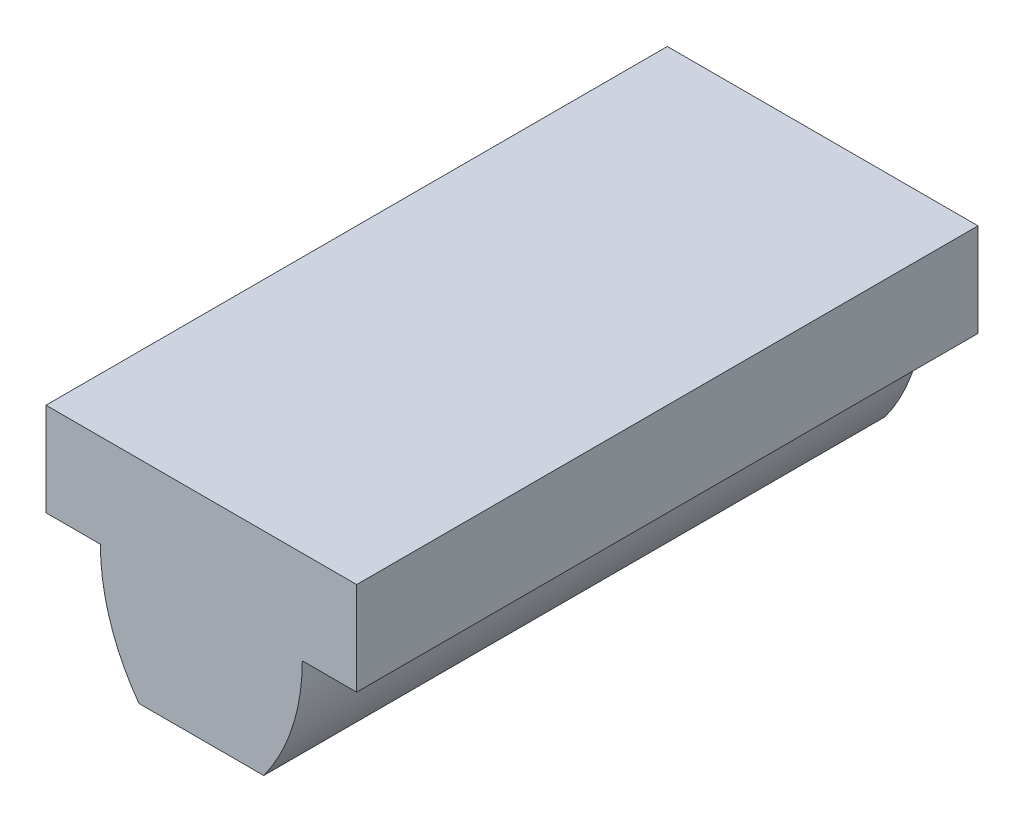
ISO-10303-21;
HEADER;
FILE_DESCRIPTION(('STEP AP214'),'2;1');
FILE_NAME('part.step','',(''),(''),'','','');
FILE_SCHEMA(('AUTOMOTIVE_DESIGN { 1 0 10303 214 1 1 1 1 }'));
ENDSEC;
DATA;
#1=APPLICATION_CONTEXT('core data for automotive mechanical design processes');
#2=APPLICATION_PROTOCOL_DEFINITION('international standard','automotive_design',2000,#1);
#3=PRODUCT_CONTEXT('',#1,'mechanical');
#4=PRODUCT('Part','Part','',(#3));
#5=PRODUCT_RELATED_PRODUCT_CATEGORY('part','',(#4));
#6=PRODUCT_DEFINITION_FORMATION('','',#4);
#7=PRODUCT_DEFINITION_CONTEXT('part definition',#1,'design');
#8=PRODUCT_DEFINITION('design','',#6,#7);
#9=PRODUCT_DEFINITION_SHAPE('','',#8);
#10=(LENGTH_UNIT() NAMED_UNIT(*) SI_UNIT(.MILLI.,.METRE.));
#11=(NAMED_UNIT(*) PLANE_ANGLE_UNIT() SI_UNIT($,.RADIAN.));
#12=(NAMED_UNIT(*) SI_UNIT($,.STERADIAN.) SOLID_ANGLE_UNIT());
#13=UNCERTAINTY_MEASURE_WITH_UNIT(LENGTH_MEASURE(1.E-05),#10,'distance_accuracy_value','');
#14=(GEOMETRIC_REPRESENTATION_CONTEXT(3) GLOBAL_UNCERTAINTY_ASSIGNED_CONTEXT((#13)) GLOBAL_UNIT_ASSIGNED_CONTEXT((#10,
#11,#12)) REPRESENTATION_CONTEXT('',''));
#15=CARTESIAN_POINT('',(0.,0.,0.));
#16=DIRECTION('',(0.,0.,1.));
#17=DIRECTION('',(1.,0.,0.));
#18=AXIS2_PLACEMENT_3D('',#15,#16,#17);
#19=CARTESIAN_POINT('',(0.,13.7523955,5.));
#20=DIRECTION('',(0.,1.,0.));
#21=DIRECTION('',(1.,0.,0.));
#22=AXIS2_PLACEMENT_3D('',#19,#20,#21);
#23=PLANE('',#22);
#24=DIRECTION('',(1.,0.,0.));
#25=VECTOR('',#24,1.);
#26=CARTESIAN_POINT('',(0.,13.7523955,5.));
#27=LINE('',#26,#25);
#28=CARTESIAN_POINT('',(20.,13.7523955,5.));
#29=VERTEX_POINT('',#28);
#30=CARTESIAN_POINT('',(25.,13.7523955,5.));
#31=VERTEX_POINT('',#30);
#32=EDGE_CURVE('E126',#29,#31,#27,.T.);
#33=ORIENTED_EDGE('',*,*,#32,.T.);
#34=DIRECTION('',(0.,0.,-1.));
#35=VECTOR('',#34,1.);
#36=CARTESIAN_POINT('',(25.,13.7523955,5.));
#37=LINE('',#36,#35);
#38=CARTESIAN_POINT('',(25.,13.7523955,-5.));
#39=VERTEX_POINT('',#38);
#40=EDGE_CURVE('E114',#31,#39,#37,.T.);
#41=ORIENTED_EDGE('',*,*,#40,.T.);
#42=DIRECTION('',(-1.,0.,0.));
#43=VECTOR('',#42,1.);
#44=CARTESIAN_POINT('',(0.,13.7523955,-5.));
#45=LINE('',#44,#43);
#46=CARTESIAN_POINT('',(20.,13.7523955,-5.));
#47=VERTEX_POINT('',#46);
#48=EDGE_CURVE('E124',#39,#47,#45,.T.);
#49=ORIENTED_EDGE('',*,*,#48,.T.);
#50=DIRECTION('',(0.,0.,1.));
#51=VECTOR('',#50,1.);
#52=CARTESIAN_POINT('',(20.,13.7523955,5.));
#53=LINE('',#52,#51);
#54=EDGE_CURVE('E128',#47,#29,#53,.T.);
#55=ORIENTED_EDGE('',*,*,#54,.T.);
#56=EDGE_LOOP('',(#33,#41,#49,#55));
#57=FACE_BOUND('',#56,.T.);
#58=ADVANCED_FACE('F41',(#57),#23,.T.);
#59=CARTESIAN_POINT('',(-14.3825635665263,-13.7523955,5.));
#60=DIRECTION('',(0.,0.,1.));
#61=DIRECTION('',(1.,0.,0.));
#62=AXIS2_PLACEMENT_3D('',#59,#60,#61);
#63=PLANE('',#62);
#64=DIRECTION('',(1.,0.,0.));
#65=VECTOR('',#64,1.);
#66=CARTESIAN_POINT('',(-14.3825635665263,12.2523954999998,5.));
#67=LINE('',#66,#65);
#68=CARTESIAN_POINT('',(24.125,12.2523954999999,5.));
#69=VERTEX_POINT('',#68);
#70=CARTESIAN_POINT('',(25.,12.2523954999998,5.));
#71=VERTEX_POINT('',#70);
#72=EDGE_CURVE('E144',#69,#71,#67,.T.);
#73=ORIENTED_EDGE('',*,*,#72,.T.);
#74=DIRECTION('',(0.,-1.,0.));
#75=VECTOR('',#74,1.);
#76=CARTESIAN_POINT('',(25.,12.2523954999999,5.));
#77=LINE('',#76,#75);
#78=EDGE_CURVE('E56',#31,#71,#77,.T.);
#79=ORIENTED_EDGE('',*,*,#78,.F.);
#80=ORIENTED_EDGE('',*,*,#32,.F.);
#81=DIRECTION('',(0.,1.,0.));
#82=VECTOR('',#81,1.);
#83=CARTESIAN_POINT('',(20.,12.2523954999999,5.));
#84=LINE('',#83,#82);
#85=CARTESIAN_POINT('',(20.,12.2523955,5.));
#86=VERTEX_POINT('',#85);
#87=EDGE_CURVE('E118',#86,#29,#84,.T.);
#88=ORIENTED_EDGE('',*,*,#87,.F.);
#89=DIRECTION('',(1.,0.,0.));
#90=VECTOR('',#89,1.);
#91=CARTESIAN_POINT('',(-14.3825635665263,12.2523954999998,5.));
#92=LINE('',#91,#90);
#93=CARTESIAN_POINT('',(20.875,12.252395499999,5.));
#94=VERTEX_POINT('',#93);
#95=EDGE_CURVE('E133',#86,#94,#92,.T.);
#96=ORIENTED_EDGE('',*,*,#95,.T.);
#97=CARTESIAN_POINT('',(24.1249999999942,12.2523954999983,5.));
#98=DIRECTION('',(0.,0.,1.));
#99=DIRECTION('',(-1.,0.,0.));
#100=AXIS2_PLACEMENT_3D('',#97,#98,#99);
#101=CIRCLE('',#100,3.24999999999418);
#102=CARTESIAN_POINT('',(21.495475328125,10.3423955,5.));
#103=VERTEX_POINT('',#102);
#104=EDGE_CURVE('E141',#94,#103,#101,.T.);
#105=ORIENTED_EDGE('',*,*,#104,.T.);
#106=DIRECTION('',(1.,0.,0.));
#107=VECTOR('',#106,1.);
#108=CARTESIAN_POINT('',(-14.3825635665263,10.3423955,5.));
#109=LINE('',#108,#107);
#110=CARTESIAN_POINT('',(23.504524671875,10.3423955,5.));
#111=VERTEX_POINT('',#110);
#112=EDGE_CURVE('E186',#103,#111,#109,.T.);
#113=ORIENTED_EDGE('',*,*,#112,.T.);
#114=CARTESIAN_POINT('',(20.8750000000059,12.2523954999983,5.));
#115=DIRECTION('',(0.,0.,1.));
#116=DIRECTION('',(-1.,0.,0.));
#117=AXIS2_PLACEMENT_3D('',#114,#115,#116);
#118=CIRCLE('',#117,3.24999999999416);
#119=EDGE_CURVE('E148',#111,#69,#118,.T.);
#120=ORIENTED_EDGE('',*,*,#119,.T.);
#121=EDGE_LOOP('',(#73,#79,#80,#88,#96,#105,#113,#120));
#122=FACE_BOUND('',#121,.T.);
#123=ADVANCED_FACE('F43',(#122),#63,.T.);
#124=CARTESIAN_POINT('',(-14.3825635665263,-13.7523955,-5.));
#125=DIRECTION('',(0.,0.,-1.));
#126=DIRECTION('',(0.,-1.,0.));
#127=AXIS2_PLACEMENT_3D('',#124,#125,#126);
#128=PLANE('',#127);
#129=ORIENTED_EDGE('',*,*,#48,.F.);
#130=DIRECTION('',(0.,-1.,0.));
#131=VECTOR('',#130,1.);
#132=CARTESIAN_POINT('',(25.,9.86876750418667,-5.));
#133=LINE('',#132,#131);
#134=CARTESIAN_POINT('',(25.,12.2523955,-5.));
#135=VERTEX_POINT('',#134);
#136=EDGE_CURVE('E111',#39,#135,#133,.T.);
#137=ORIENTED_EDGE('',*,*,#136,.T.);
#138=DIRECTION('',(-1.,0.,0.));
#139=VECTOR('',#138,1.);
#140=CARTESIAN_POINT('',(-14.3825635665263,12.2523955,-5.));
#141=LINE('',#140,#139);
#142=CARTESIAN_POINT('',(24.125,12.2523955,-5.));
#143=VERTEX_POINT('',#142);
#144=EDGE_CURVE('E149',#135,#143,#141,.T.);
#145=ORIENTED_EDGE('',*,*,#144,.T.);
#146=CARTESIAN_POINT('',(20.8750000000059,12.2523954999983,-5.));
#147=DIRECTION('',(0.,0.,-1.));
#148=DIRECTION('',(-1.,0.,0.));
#149=AXIS2_PLACEMENT_3D('',#146,#147,#148);
#150=CIRCLE('',#149,3.24999999999416);
#151=CARTESIAN_POINT('',(23.504524671875,10.3423955,-5.));
#152=VERTEX_POINT('',#151);
#153=EDGE_CURVE('E190',#143,#152,#150,.T.);
#154=ORIENTED_EDGE('',*,*,#153,.T.);
#155=DIRECTION('',(-1.,0.,0.));
#156=VECTOR('',#155,1.);
#157=CARTESIAN_POINT('',(-14.3825635665263,10.3423955,-5.));
#158=LINE('',#157,#156);
#159=CARTESIAN_POINT('',(21.495475328125,10.3423955,-5.));
#160=VERTEX_POINT('',#159);
#161=EDGE_CURVE('E158',#152,#160,#158,.T.);
#162=ORIENTED_EDGE('',*,*,#161,.T.);
#163=CARTESIAN_POINT('',(24.1249999999942,12.2523954999983,-5.));
#164=DIRECTION('',(0.,0.,-1.));
#165=DIRECTION('',(-1.,0.,0.));
#166=AXIS2_PLACEMENT_3D('',#163,#164,#165);
#167=CIRCLE('',#166,3.24999999999418);
#168=CARTESIAN_POINT('',(20.875,12.2523954999991,-5.));
#169=VERTEX_POINT('',#168);
#170=EDGE_CURVE('E153',#160,#169,#167,.T.);
#171=ORIENTED_EDGE('',*,*,#170,.T.);
#172=DIRECTION('',(-1.,0.,0.));
#173=VECTOR('',#172,1.);
#174=CARTESIAN_POINT('',(-14.3825635665263,12.2523955,-5.));
#175=LINE('',#174,#173);
#176=CARTESIAN_POINT('',(20.,12.2523955,-5.));
#177=VERTEX_POINT('',#176);
#178=EDGE_CURVE('E150',#169,#177,#175,.T.);
#179=ORIENTED_EDGE('',*,*,#178,.T.);
#180=DIRECTION('',(0.,1.,0.));
#181=VECTOR('',#180,1.);
#182=CARTESIAN_POINT('',(20.,12.2523954999999,-5.));
#183=LINE('',#182,#181);
#184=EDGE_CURVE('E63',#177,#47,#183,.T.);
#185=ORIENTED_EDGE('',*,*,#184,.T.);
#186=EDGE_LOOP('',(#129,#137,#145,#154,#162,#171,#179,#185));
#187=FACE_BOUND('',#186,.T.);
#188=ADVANCED_FACE('F130',(#187),#128,.T.);
#189=CARTESIAN_POINT('',(24.125,12.2523955,-5.));
#190=DIRECTION('',(0.,-1.,0.));
#191=DIRECTION('',(0.,0.,-1.));
#192=AXIS2_PLACEMENT_3D('',#189,#190,#191);
#193=PLANE('',#192);
#194=ORIENTED_EDGE('',*,*,#144,.F.);
#195=DIRECTION('',(0.,0.,1.));
#196=VECTOR('',#195,1.);
#197=CARTESIAN_POINT('',(25.,12.2523955,-5.));
#198=LINE('',#197,#196);
#199=EDGE_CURVE('E12',#135,#71,#198,.T.);
#200=ORIENTED_EDGE('',*,*,#199,.T.);
#201=ORIENTED_EDGE('',*,*,#72,.F.);
#202=DIRECTION('',(0.,0.,-1.));
#203=VECTOR('',#202,1.);
#204=CARTESIAN_POINT('',(24.125,12.2523955,-5.));
#205=LINE('',#204,#203);
#206=EDGE_CURVE('E154',#69,#143,#205,.T.);
#207=ORIENTED_EDGE('',*,*,#206,.T.);
#208=EDGE_LOOP('',(#194,#200,#201,#207));
#209=FACE_BOUND('',#208,.T.);
#210=ADVANCED_FACE('F212',(#209),#193,.T.);
#211=CARTESIAN_POINT('',(19.125,12.2523955,-5.));
#212=DIRECTION('',(0.,-1.,0.));
#213=DIRECTION('',(0.,0.,-1.));
#214=AXIS2_PLACEMENT_3D('',#211,#212,#213);
#215=PLANE('',#214);
#216=ORIENTED_EDGE('',*,*,#95,.F.);
#217=DIRECTION('',(0.,0.,-1.));
#218=VECTOR('',#217,1.);
#219=CARTESIAN_POINT('',(20.,12.2523955,-5.));
#220=LINE('',#219,#218);
#221=EDGE_CURVE('E49',#86,#177,#220,.T.);
#222=ORIENTED_EDGE('',*,*,#221,.T.);
#223=ORIENTED_EDGE('',*,*,#178,.F.);
#224=DIRECTION('',(0.,0.,-1.));
#225=VECTOR('',#224,1.);
#226=CARTESIAN_POINT('',(20.875,12.2523954999983,5.));
#227=LINE('',#226,#225);
#228=EDGE_CURVE('E127',#94,#169,#227,.T.);
#229=ORIENTED_EDGE('',*,*,#228,.F.);
#230=EDGE_LOOP('',(#216,#222,#223,#229));
#231=FACE_BOUND('',#230,.T.);
#232=ADVANCED_FACE('F164',(#231),#215,.T.);
#233=CARTESIAN_POINT('',(20.8750000000059,12.2523954999983,5.));
#234=DIRECTION('',(0.,0.,-1.));
#235=DIRECTION('',(-1.,0.,0.));
#236=AXIS2_PLACEMENT_3D('',#233,#234,#235);
#237=CYLINDRICAL_SURFACE('',#236,3.24999999999416);
#238=ORIENTED_EDGE('',*,*,#119,.F.);
#239=DIRECTION('',(0.,0.,-1.));
#240=VECTOR('',#239,1.);
#241=CARTESIAN_POINT('',(23.504524671875,10.3423955,5.));
#242=LINE('',#241,#240);
#243=EDGE_CURVE('E161',#111,#152,#242,.T.);
#244=ORIENTED_EDGE('',*,*,#243,.T.);
#245=ORIENTED_EDGE('',*,*,#153,.F.);
#246=ORIENTED_EDGE('',*,*,#206,.F.);
#247=EDGE_LOOP('',(#238,#244,#245,#246));
#248=FACE_BOUND('',#247,.T.);
#249=ADVANCED_FACE('F210',(#248),#237,.T.);
#250=CARTESIAN_POINT('',(21.495475328125,10.3423955,-5.));
#251=DIRECTION('',(0.,-1.,0.));
#252=DIRECTION('',(0.,0.,-1.));
#253=AXIS2_PLACEMENT_3D('',#250,#251,#252);
#254=PLANE('',#253);
#255=ORIENTED_EDGE('',*,*,#112,.F.);
#256=DIRECTION('',(0.,0.,-1.));
#257=VECTOR('',#256,1.);
#258=CARTESIAN_POINT('',(21.495475328125,10.3423955,-5.));
#259=LINE('',#258,#257);
#260=EDGE_CURVE('E177',#103,#160,#259,.T.);
#261=ORIENTED_EDGE('',*,*,#260,.T.);
#262=ORIENTED_EDGE('',*,*,#161,.F.);
#263=ORIENTED_EDGE('',*,*,#243,.F.);
#264=EDGE_LOOP('',(#255,#261,#262,#263));
#265=FACE_BOUND('',#264,.T.);
#266=ADVANCED_FACE('F214',(#265),#254,.T.);
#267=CARTESIAN_POINT('',(24.1249999999942,12.2523954999983,5.));
#268=DIRECTION('',(0.,0.,-1.));
#269=DIRECTION('',(-1.,0.,0.));
#270=AXIS2_PLACEMENT_3D('',#267,#268,#269);
#271=CYLINDRICAL_SURFACE('',#270,3.24999999999418);
#272=ORIENTED_EDGE('',*,*,#104,.F.);
#273=ORIENTED_EDGE('',*,*,#228,.T.);
#274=ORIENTED_EDGE('',*,*,#170,.F.);
#275=ORIENTED_EDGE('',*,*,#260,.F.);
#276=EDGE_LOOP('',(#272,#273,#274,#275));
#277=FACE_BOUND('',#276,.T.);
#278=ADVANCED_FACE('F174',(#277),#271,.T.);
#279=CARTESIAN_POINT('',(20.,12.2523954999999,5.));
#280=DIRECTION('',(-1.,0.,0.));
#281=DIRECTION('',(0.,0.,1.));
#282=AXIS2_PLACEMENT_3D('',#279,#280,#281);
#283=PLANE('',#282);
#284=ORIENTED_EDGE('',*,*,#184,.F.);
#285=ORIENTED_EDGE('',*,*,#221,.F.);
#286=ORIENTED_EDGE('',*,*,#87,.T.);
#287=ORIENTED_EDGE('',*,*,#54,.F.);
#288=EDGE_LOOP('',(#284,#285,#286,#287));
#289=FACE_BOUND('',#288,.T.);
#290=ADVANCED_FACE('F218',(#289),#283,.T.);
#291=CARTESIAN_POINT('',(25.,9.86876750418667,5.));
#292=DIRECTION('',(1.,0.,0.));
#293=DIRECTION('',(0.,1.,0.));
#294=AXIS2_PLACEMENT_3D('',#291,#292,#293);
#295=PLANE('',#294);
#296=ORIENTED_EDGE('',*,*,#78,.T.);
#297=ORIENTED_EDGE('',*,*,#199,.F.);
#298=ORIENTED_EDGE('',*,*,#136,.F.);
#299=ORIENTED_EDGE('',*,*,#40,.F.);
#300=EDGE_LOOP('',(#296,#297,#298,#299));
#301=FACE_BOUND('',#300,.T.);
#302=ADVANCED_FACE('F113',(#301),#295,.T.);
#303=CLOSED_SHELL('',(#58,#123,#188,#210,#232,#249,#266,#278,#290,#302));
#304=MANIFOLD_SOLID_BREP('B2',#303);
#305=ADVANCED_BREP_SHAPE_REPRESENTATION('',(#18,#304),#14);
#306=SHAPE_DEFINITION_REPRESENTATION(#9,#305);
ENDSEC;
END-ISO-10303-21;
